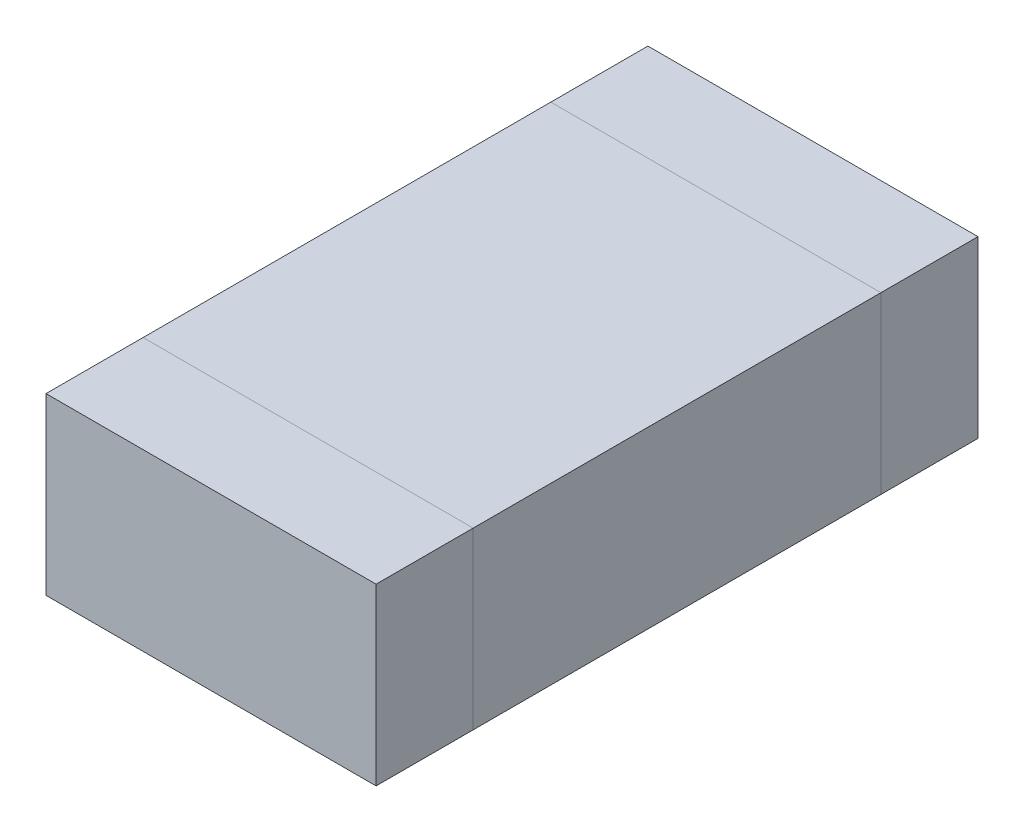
ISO-10303-21;
HEADER;
FILE_DESCRIPTION(('STEP AP214'),'2;1');
FILE_NAME('part.step','',(''),(''),'','','');
FILE_SCHEMA(('AUTOMOTIVE_DESIGN { 1 0 10303 214 1 1 1 1 }'));
ENDSEC;
DATA;
#1=APPLICATION_CONTEXT('core data for automotive mechanical design processes');
#2=APPLICATION_PROTOCOL_DEFINITION('international standard','automotive_design',2000,#1);
#3=PRODUCT_CONTEXT('',#1,'mechanical');
#4=PRODUCT('Part','Part','',(#3));
#5=PRODUCT_RELATED_PRODUCT_CATEGORY('part','',(#4));
#6=PRODUCT_DEFINITION_FORMATION('','',#4);
#7=PRODUCT_DEFINITION_CONTEXT('part definition',#1,'design');
#8=PRODUCT_DEFINITION('design','',#6,#7);
#9=PRODUCT_DEFINITION_SHAPE('','',#8);
#10=(LENGTH_UNIT() NAMED_UNIT(*) SI_UNIT(.MILLI.,.METRE.));
#11=(NAMED_UNIT(*) PLANE_ANGLE_UNIT() SI_UNIT($,.RADIAN.));
#12=(NAMED_UNIT(*) SI_UNIT($,.STERADIAN.) SOLID_ANGLE_UNIT());
#13=UNCERTAINTY_MEASURE_WITH_UNIT(LENGTH_MEASURE(1.E-05),#10,'distance_accuracy_value','');
#14=(GEOMETRIC_REPRESENTATION_CONTEXT(3) GLOBAL_UNCERTAINTY_ASSIGNED_CONTEXT((#13)) GLOBAL_UNIT_ASSIGNED_CONTEXT((#10,
#11,#12)) REPRESENTATION_CONTEXT('',''));
#15=CARTESIAN_POINT('',(0.,0.,0.));
#16=DIRECTION('',(0.,0.,1.));
#17=DIRECTION('',(1.,0.,0.));
#18=AXIS2_PLACEMENT_3D('',#15,#16,#17);
#19=CARTESIAN_POINT('',(0.,0.45,0.));
#20=DIRECTION('',(0.,1.,0.));
#21=DIRECTION('',(0.,0.,1.));
#22=AXIS2_PLACEMENT_3D('',#19,#20,#21);
#23=PLANE('',#22);
#24=DIRECTION('',(0.,0.,-1.));
#25=VECTOR('',#24,1.);
#26=CARTESIAN_POINT('',(-0.425,0.45,-0.525));
#27=LINE('',#26,#25);
#28=CARTESIAN_POINT('',(-0.425,0.45,-0.525));
#29=VERTEX_POINT('',#28);
#30=CARTESIAN_POINT('',(-0.425,0.45,-0.775));
#31=VERTEX_POINT('',#30);
#32=EDGE_CURVE('E51',#29,#31,#27,.T.);
#33=ORIENTED_EDGE('',*,*,#32,.F.);
#34=DIRECTION('',(-1.,0.,0.));
#35=VECTOR('',#34,1.);
#36=CARTESIAN_POINT('',(-0.425,0.45,-0.525));
#37=LINE('',#36,#35);
#38=CARTESIAN_POINT('',(0.425,0.45,-0.525));
#39=VERTEX_POINT('',#38);
#40=EDGE_CURVE('E74',#39,#29,#37,.T.);
#41=ORIENTED_EDGE('',*,*,#40,.F.);
#42=DIRECTION('',(0.,0.,1.));
#43=VECTOR('',#42,1.);
#44=CARTESIAN_POINT('',(0.425,0.45,-0.525));
#45=LINE('',#44,#43);
#46=CARTESIAN_POINT('',(0.425,0.45,-0.775));
#47=VERTEX_POINT('',#46);
#48=EDGE_CURVE('E79',#47,#39,#45,.T.);
#49=ORIENTED_EDGE('',*,*,#48,.F.);
#50=DIRECTION('',(1.,0.,0.));
#51=VECTOR('',#50,1.);
#52=CARTESIAN_POINT('',(-0.425,0.45,-0.775));
#53=LINE('',#52,#51);
#54=EDGE_CURVE('E94',#31,#47,#53,.T.);
#55=ORIENTED_EDGE('',*,*,#54,.F.);
#56=EDGE_LOOP('',(#33,#41,#49,#55));
#57=FACE_BOUND('',#56,.T.);
#58=ADVANCED_FACE('F43',(#57),#23,.T.);
#59=CARTESIAN_POINT('',(0.,0.,0.));
#60=DIRECTION('',(0.,-1.,0.));
#61=DIRECTION('',(0.,0.,-1.));
#62=AXIS2_PLACEMENT_3D('',#59,#60,#61);
#63=PLANE('',#62);
#64=DIRECTION('',(0.,0.,-1.));
#65=VECTOR('',#64,1.);
#66=CARTESIAN_POINT('',(-0.425,0.,-0.525));
#67=LINE('',#66,#65);
#68=CARTESIAN_POINT('',(-0.425,0.,-0.525));
#69=VERTEX_POINT('',#68);
#70=CARTESIAN_POINT('',(-0.425,0.,-0.775));
#71=VERTEX_POINT('',#70);
#72=EDGE_CURVE('E103',#69,#71,#67,.T.);
#73=ORIENTED_EDGE('',*,*,#72,.T.);
#74=DIRECTION('',(1.,0.,0.));
#75=VECTOR('',#74,1.);
#76=CARTESIAN_POINT('',(-0.425,0.,-0.775));
#77=LINE('',#76,#75);
#78=CARTESIAN_POINT('',(0.425,0.,-0.775));
#79=VERTEX_POINT('',#78);
#80=EDGE_CURVE('E92',#71,#79,#77,.T.);
#81=ORIENTED_EDGE('',*,*,#80,.T.);
#82=DIRECTION('',(0.,0.,1.));
#83=VECTOR('',#82,1.);
#84=CARTESIAN_POINT('',(0.425,0.,-0.525));
#85=LINE('',#84,#83);
#86=CARTESIAN_POINT('',(0.425,0.,-0.525));
#87=VERTEX_POINT('',#86);
#88=EDGE_CURVE('E95',#79,#87,#85,.T.);
#89=ORIENTED_EDGE('',*,*,#88,.T.);
#90=DIRECTION('',(-1.,0.,0.));
#91=VECTOR('',#90,1.);
#92=CARTESIAN_POINT('',(-0.425,0.,-0.525));
#93=LINE('',#92,#91);
#94=EDGE_CURVE('E100',#87,#69,#93,.T.);
#95=ORIENTED_EDGE('',*,*,#94,.T.);
#96=EDGE_LOOP('',(#73,#81,#89,#95));
#97=FACE_BOUND('',#96,.T.);
#98=ADVANCED_FACE('F102',(#97),#63,.T.);
#99=CARTESIAN_POINT('',(-0.425,1.33600225733347,-0.775));
#100=DIRECTION('',(0.,0.,-1.));
#101=DIRECTION('',(-1.,0.,0.));
#102=AXIS2_PLACEMENT_3D('',#99,#100,#101);
#103=PLANE('',#102);
#104=DIRECTION('',(0.,-1.,0.));
#105=VECTOR('',#104,1.);
#106=CARTESIAN_POINT('',(-0.425,1.33600225733347,-0.775));
#107=LINE('',#106,#105);
#108=EDGE_CURVE('E12',#31,#71,#107,.T.);
#109=ORIENTED_EDGE('',*,*,#108,.F.);
#110=ORIENTED_EDGE('',*,*,#54,.T.);
#111=DIRECTION('',(0.,-1.,0.));
#112=VECTOR('',#111,1.);
#113=CARTESIAN_POINT('',(0.425,1.33600225733347,-0.775));
#114=LINE('',#113,#112);
#115=EDGE_CURVE('E89',#47,#79,#114,.T.);
#116=ORIENTED_EDGE('',*,*,#115,.T.);
#117=ORIENTED_EDGE('',*,*,#80,.F.);
#118=EDGE_LOOP('',(#109,#110,#116,#117));
#119=FACE_BOUND('',#118,.T.);
#120=ADVANCED_FACE('F90',(#119),#103,.T.);
#121=CARTESIAN_POINT('',(0.425,1.33600225733347,-0.525));
#122=DIRECTION('',(1.,0.,0.));
#123=DIRECTION('',(0.,0.,-1.));
#124=AXIS2_PLACEMENT_3D('',#121,#122,#123);
#125=PLANE('',#124);
#126=ORIENTED_EDGE('',*,*,#115,.F.);
#127=ORIENTED_EDGE('',*,*,#48,.T.);
#128=DIRECTION('',(0.,-1.,0.));
#129=VECTOR('',#128,1.);
#130=CARTESIAN_POINT('',(0.425,1.33600225733347,-0.525));
#131=LINE('',#130,#129);
#132=EDGE_CURVE('E84',#39,#87,#131,.T.);
#133=ORIENTED_EDGE('',*,*,#132,.T.);
#134=ORIENTED_EDGE('',*,*,#88,.F.);
#135=EDGE_LOOP('',(#126,#127,#133,#134));
#136=FACE_BOUND('',#135,.T.);
#137=ADVANCED_FACE('F96',(#136),#125,.T.);
#138=CARTESIAN_POINT('',(-0.425,1.33600225733347,-0.525));
#139=DIRECTION('',(0.,0.,1.));
#140=DIRECTION('',(1.,0.,0.));
#141=AXIS2_PLACEMENT_3D('',#138,#139,#140);
#142=PLANE('',#141);
#143=ORIENTED_EDGE('',*,*,#132,.F.);
#144=ORIENTED_EDGE('',*,*,#40,.T.);
#145=DIRECTION('',(0.,-1.,0.));
#146=VECTOR('',#145,1.);
#147=CARTESIAN_POINT('',(-0.425,1.33600225733347,-0.525));
#148=LINE('',#147,#146);
#149=EDGE_CURVE('E110',#29,#69,#148,.T.);
#150=ORIENTED_EDGE('',*,*,#149,.T.);
#151=ORIENTED_EDGE('',*,*,#94,.F.);
#152=EDGE_LOOP('',(#143,#144,#150,#151));
#153=FACE_BOUND('',#152,.T.);
#154=ADVANCED_FACE('F116',(#153),#142,.T.);
#155=CARTESIAN_POINT('',(-0.425,1.33600225733347,-0.525));
#156=DIRECTION('',(-1.,0.,0.));
#157=DIRECTION('',(0.,0.,1.));
#158=AXIS2_PLACEMENT_3D('',#155,#156,#157);
#159=PLANE('',#158);
#160=ORIENTED_EDGE('',*,*,#149,.F.);
#161=ORIENTED_EDGE('',*,*,#32,.T.);
#162=ORIENTED_EDGE('',*,*,#108,.T.);
#163=ORIENTED_EDGE('',*,*,#72,.F.);
#164=EDGE_LOOP('',(#160,#161,#162,#163));
#165=FACE_BOUND('',#164,.T.);
#166=ADVANCED_FACE('F117',(#165),#159,.T.);
#167=CLOSED_SHELL('',(#58,#98,#120,#137,#154,#166));
#168=MANIFOLD_SOLID_BREP('B2',#167);
#169=CARTESIAN_POINT('',(0.,0.45,0.));
#170=DIRECTION('',(0.,1.,0.));
#171=DIRECTION('',(0.,0.,1.));
#172=AXIS2_PLACEMENT_3D('',#169,#170,#171);
#173=PLANE('',#172);
#174=DIRECTION('',(0.,0.,-1.));
#175=VECTOR('',#174,1.);
#176=CARTESIAN_POINT('',(-0.425,0.45,0.525));
#177=LINE('',#176,#175);
#178=CARTESIAN_POINT('',(-0.425,0.45,0.775));
#179=VERTEX_POINT('',#178);
#180=CARTESIAN_POINT('',(-0.425,0.45,0.525));
#181=VERTEX_POINT('',#180);
#182=EDGE_CURVE('E183',#179,#181,#177,.T.);
#183=ORIENTED_EDGE('',*,*,#182,.F.);
#184=DIRECTION('',(-1.,0.,0.));
#185=VECTOR('',#184,1.);
#186=CARTESIAN_POINT('',(-0.425,0.45,0.775));
#187=LINE('',#186,#185);
#188=CARTESIAN_POINT('',(0.425,0.45,0.775));
#189=VERTEX_POINT('',#188);
#190=EDGE_CURVE('E206',#189,#179,#187,.T.);
#191=ORIENTED_EDGE('',*,*,#190,.F.);
#192=DIRECTION('',(0.,0.,1.));
#193=VECTOR('',#192,1.);
#194=CARTESIAN_POINT('',(0.425,0.45,0.525));
#195=LINE('',#194,#193);
#196=CARTESIAN_POINT('',(0.425,0.45,0.525));
#197=VERTEX_POINT('',#196);
#198=EDGE_CURVE('E211',#197,#189,#195,.T.);
#199=ORIENTED_EDGE('',*,*,#198,.F.);
#200=DIRECTION('',(1.,0.,0.));
#201=VECTOR('',#200,1.);
#202=CARTESIAN_POINT('',(-0.425,0.45,0.525));
#203=LINE('',#202,#201);
#204=EDGE_CURVE('E226',#181,#197,#203,.T.);
#205=ORIENTED_EDGE('',*,*,#204,.F.);
#206=EDGE_LOOP('',(#183,#191,#199,#205));
#207=FACE_BOUND('',#206,.T.);
#208=ADVANCED_FACE('F175',(#207),#173,.T.);
#209=CARTESIAN_POINT('',(0.,0.,0.));
#210=DIRECTION('',(0.,1.,0.));
#211=DIRECTION('',(0.,0.,1.));
#212=AXIS2_PLACEMENT_3D('',#209,#210,#211);
#213=PLANE('',#212);
#214=DIRECTION('',(0.,0.,-1.));
#215=VECTOR('',#214,1.);
#216=CARTESIAN_POINT('',(-0.425,0.,0.525));
#217=LINE('',#216,#215);
#218=CARTESIAN_POINT('',(-0.425,0.,0.775));
#219=VERTEX_POINT('',#218);
#220=CARTESIAN_POINT('',(-0.425,0.,0.525));
#221=VERTEX_POINT('',#220);
#222=EDGE_CURVE('E235',#219,#221,#217,.T.);
#223=ORIENTED_EDGE('',*,*,#222,.T.);
#224=DIRECTION('',(1.,0.,0.));
#225=VECTOR('',#224,1.);
#226=CARTESIAN_POINT('',(-0.425,0.,0.525));
#227=LINE('',#226,#225);
#228=CARTESIAN_POINT('',(0.425,0.,0.525));
#229=VERTEX_POINT('',#228);
#230=EDGE_CURVE('E224',#221,#229,#227,.T.);
#231=ORIENTED_EDGE('',*,*,#230,.T.);
#232=DIRECTION('',(0.,0.,1.));
#233=VECTOR('',#232,1.);
#234=CARTESIAN_POINT('',(0.425,0.,0.525));
#235=LINE('',#234,#233);
#236=CARTESIAN_POINT('',(0.425,0.,0.775));
#237=VERTEX_POINT('',#236);
#238=EDGE_CURVE('E227',#229,#237,#235,.T.);
#239=ORIENTED_EDGE('',*,*,#238,.T.);
#240=DIRECTION('',(-1.,0.,0.));
#241=VECTOR('',#240,1.);
#242=CARTESIAN_POINT('',(-0.425,0.,0.775));
#243=LINE('',#242,#241);
#244=EDGE_CURVE('E232',#237,#219,#243,.T.);
#245=ORIENTED_EDGE('',*,*,#244,.T.);
#246=EDGE_LOOP('',(#223,#231,#239,#245));
#247=FACE_BOUND('',#246,.T.);
#248=ADVANCED_FACE('F234',(#247),#213,.F.);
#249=CARTESIAN_POINT('',(-0.425,1.33600225733347,0.525));
#250=DIRECTION('',(0.,0.,-1.));
#251=DIRECTION('',(-1.,0.,0.));
#252=AXIS2_PLACEMENT_3D('',#249,#250,#251);
#253=PLANE('',#252);
#254=DIRECTION('',(0.,-1.,0.));
#255=VECTOR('',#254,1.);
#256=CARTESIAN_POINT('',(-0.425,1.33600225733347,0.525));
#257=LINE('',#256,#255);
#258=EDGE_CURVE('E41',#181,#221,#257,.T.);
#259=ORIENTED_EDGE('',*,*,#258,.F.);
#260=ORIENTED_EDGE('',*,*,#204,.T.);
#261=DIRECTION('',(0.,-1.,0.));
#262=VECTOR('',#261,1.);
#263=CARTESIAN_POINT('',(0.425,1.33600225733347,0.525));
#264=LINE('',#263,#262);
#265=EDGE_CURVE('E221',#197,#229,#264,.T.);
#266=ORIENTED_EDGE('',*,*,#265,.T.);
#267=ORIENTED_EDGE('',*,*,#230,.F.);
#268=EDGE_LOOP('',(#259,#260,#266,#267));
#269=FACE_BOUND('',#268,.T.);
#270=ADVANCED_FACE('F222',(#269),#253,.T.);
#271=CARTESIAN_POINT('',(0.425,1.33600225733347,0.525));
#272=DIRECTION('',(1.,0.,0.));
#273=DIRECTION('',(0.,0.,-1.));
#274=AXIS2_PLACEMENT_3D('',#271,#272,#273);
#275=PLANE('',#274);
#276=ORIENTED_EDGE('',*,*,#265,.F.);
#277=ORIENTED_EDGE('',*,*,#198,.T.);
#278=DIRECTION('',(0.,-1.,0.));
#279=VECTOR('',#278,1.);
#280=CARTESIAN_POINT('',(0.425,1.33600225733347,0.775));
#281=LINE('',#280,#279);
#282=EDGE_CURVE('E216',#189,#237,#281,.T.);
#283=ORIENTED_EDGE('',*,*,#282,.T.);
#284=ORIENTED_EDGE('',*,*,#238,.F.);
#285=EDGE_LOOP('',(#276,#277,#283,#284));
#286=FACE_BOUND('',#285,.T.);
#287=ADVANCED_FACE('F228',(#286),#275,.T.);
#288=CARTESIAN_POINT('',(-0.425,1.33600225733347,0.775));
#289=DIRECTION('',(0.,0.,1.));
#290=DIRECTION('',(1.,0.,0.));
#291=AXIS2_PLACEMENT_3D('',#288,#289,#290);
#292=PLANE('',#291);
#293=ORIENTED_EDGE('',*,*,#282,.F.);
#294=ORIENTED_EDGE('',*,*,#190,.T.);
#295=DIRECTION('',(0.,-1.,0.));
#296=VECTOR('',#295,1.);
#297=CARTESIAN_POINT('',(-0.425,1.33600225733347,0.775));
#298=LINE('',#297,#296);
#299=EDGE_CURVE('E242',#179,#219,#298,.T.);
#300=ORIENTED_EDGE('',*,*,#299,.T.);
#301=ORIENTED_EDGE('',*,*,#244,.F.);
#302=EDGE_LOOP('',(#293,#294,#300,#301));
#303=FACE_BOUND('',#302,.T.);
#304=ADVANCED_FACE('F248',(#303),#292,.T.);
#305=CARTESIAN_POINT('',(-0.425,1.33600225733347,0.525));
#306=DIRECTION('',(-1.,0.,0.));
#307=DIRECTION('',(0.,0.,1.));
#308=AXIS2_PLACEMENT_3D('',#305,#306,#307);
#309=PLANE('',#308);
#310=ORIENTED_EDGE('',*,*,#299,.F.);
#311=ORIENTED_EDGE('',*,*,#182,.T.);
#312=ORIENTED_EDGE('',*,*,#258,.T.);
#313=ORIENTED_EDGE('',*,*,#222,.F.);
#314=EDGE_LOOP('',(#310,#311,#312,#313));
#315=FACE_BOUND('',#314,.T.);
#316=ADVANCED_FACE('F249',(#315),#309,.T.);
#317=CLOSED_SHELL('',(#208,#248,#270,#287,#304,#316));
#318=MANIFOLD_SOLID_BREP('B6',#317);
#319=CARTESIAN_POINT('',(0.425,0.45,-0.525));
#320=DIRECTION('',(-1.,0.,0.));
#321=DIRECTION('',(0.,0.,1.));
#322=AXIS2_PLACEMENT_3D('',#319,#320,#321);
#323=PLANE('',#322);
#324=DIRECTION('',(0.,0.,-1.));
#325=VECTOR('',#324,1.);
#326=CARTESIAN_POINT('',(0.425,0.,-0.525));
#327=LINE('',#326,#325);
#328=CARTESIAN_POINT('',(0.425,0.,0.525));
#329=VERTEX_POINT('',#328);
#330=CARTESIAN_POINT('',(0.425,0.,-0.525));
#331=VERTEX_POINT('',#330);
#332=EDGE_CURVE('E361',#329,#331,#327,.T.);
#333=ORIENTED_EDGE('',*,*,#332,.T.);
#334=DIRECTION('',(0.,-1.,0.));
#335=VECTOR('',#334,1.);
#336=CARTESIAN_POINT('',(0.425,0.45,-0.525));
#337=LINE('',#336,#335);
#338=CARTESIAN_POINT('',(0.425,0.45,-0.525));
#339=VERTEX_POINT('',#338);
#340=EDGE_CURVE('E173',#339,#331,#337,.T.);
#341=ORIENTED_EDGE('',*,*,#340,.F.);
#342=DIRECTION('',(0.,0.,-1.));
#343=VECTOR('',#342,1.);
#344=CARTESIAN_POINT('',(0.425,0.45,-0.525));
#345=LINE('',#344,#343);
#346=CARTESIAN_POINT('',(0.425,0.45,0.525));
#347=VERTEX_POINT('',#346);
#348=EDGE_CURVE('E349',#347,#339,#345,.T.);
#349=ORIENTED_EDGE('',*,*,#348,.F.);
#350=DIRECTION('',(0.,-1.,0.));
#351=VECTOR('',#350,1.);
#352=CARTESIAN_POINT('',(0.425,0.45,0.525));
#353=LINE('',#352,#351);
#354=EDGE_CURVE('E357',#347,#329,#353,.T.);
#355=ORIENTED_EDGE('',*,*,#354,.T.);
#356=EDGE_LOOP('',(#333,#341,#349,#355));
#357=FACE_BOUND('',#356,.T.);
#358=ADVANCED_FACE('F298',(#357),#323,.F.);
#359=CARTESIAN_POINT('',(-0.425,0.45,-0.525));
#360=DIRECTION('',(0.,0.,1.));
#361=DIRECTION('',(1.,0.,0.));
#362=AXIS2_PLACEMENT_3D('',#359,#360,#361);
#363=PLANE('',#362);
#364=DIRECTION('',(-1.,0.,0.));
#365=VECTOR('',#364,1.);
#366=CARTESIAN_POINT('',(-0.425,0.,-0.525));
#367=LINE('',#366,#365);
#368=CARTESIAN_POINT('',(-0.425,0.,-0.525));
#369=VERTEX_POINT('',#368);
#370=EDGE_CURVE('E353',#331,#369,#367,.T.);
#371=ORIENTED_EDGE('',*,*,#370,.T.);
#372=DIRECTION('',(0.,-1.,0.));
#373=VECTOR('',#372,1.);
#374=CARTESIAN_POINT('',(-0.425,0.45,-0.525));
#375=LINE('',#374,#373);
#376=CARTESIAN_POINT('',(-0.425,0.45,-0.525));
#377=VERTEX_POINT('',#376);
#378=EDGE_CURVE('E306',#377,#369,#375,.T.);
#379=ORIENTED_EDGE('',*,*,#378,.F.);
#380=DIRECTION('',(-1.,0.,0.));
#381=VECTOR('',#380,1.);
#382=CARTESIAN_POINT('',(-0.425,0.45,-0.525));
#383=LINE('',#382,#381);
#384=EDGE_CURVE('E344',#339,#377,#383,.T.);
#385=ORIENTED_EDGE('',*,*,#384,.F.);
#386=ORIENTED_EDGE('',*,*,#340,.T.);
#387=EDGE_LOOP('',(#371,#379,#385,#386));
#388=FACE_BOUND('',#387,.T.);
#389=ADVANCED_FACE('F352',(#388),#363,.F.);
#390=CARTESIAN_POINT('',(-0.425,0.45,-0.525));
#391=DIRECTION('',(1.,0.,0.));
#392=DIRECTION('',(0.,0.,-1.));
#393=AXIS2_PLACEMENT_3D('',#390,#391,#392);
#394=PLANE('',#393);
#395=DIRECTION('',(0.,0.,1.));
#396=VECTOR('',#395,1.);
#397=CARTESIAN_POINT('',(-0.425,0.,-0.525));
#398=LINE('',#397,#396);
#399=CARTESIAN_POINT('',(-0.425,0.,0.525));
#400=VERTEX_POINT('',#399);
#401=EDGE_CURVE('E331',#369,#400,#398,.T.);
#402=ORIENTED_EDGE('',*,*,#401,.T.);
#403=DIRECTION('',(0.,-1.,0.));
#404=VECTOR('',#403,1.);
#405=CARTESIAN_POINT('',(-0.425,0.45,0.525));
#406=LINE('',#405,#404);
#407=CARTESIAN_POINT('',(-0.425,0.45,0.525));
#408=VERTEX_POINT('',#407);
#409=EDGE_CURVE('E354',#408,#400,#406,.T.);
#410=ORIENTED_EDGE('',*,*,#409,.F.);
#411=DIRECTION('',(0.,0.,1.));
#412=VECTOR('',#411,1.);
#413=CARTESIAN_POINT('',(-0.425,0.45,-0.525));
#414=LINE('',#413,#412);
#415=EDGE_CURVE('E347',#377,#408,#414,.T.);
#416=ORIENTED_EDGE('',*,*,#415,.F.);
#417=ORIENTED_EDGE('',*,*,#378,.T.);
#418=EDGE_LOOP('',(#402,#410,#416,#417));
#419=FACE_BOUND('',#418,.T.);
#420=ADVANCED_FACE('F355',(#419),#394,.F.);
#421=CARTESIAN_POINT('',(-0.425,0.45,0.525));
#422=DIRECTION('',(0.,0.,-1.));
#423=DIRECTION('',(-1.,0.,0.));
#424=AXIS2_PLACEMENT_3D('',#421,#422,#423);
#425=PLANE('',#424);
#426=DIRECTION('',(1.,0.,0.));
#427=VECTOR('',#426,1.);
#428=CARTESIAN_POINT('',(-0.425,0.,0.525));
#429=LINE('',#428,#427);
#430=EDGE_CURVE('E337',#400,#329,#429,.T.);
#431=ORIENTED_EDGE('',*,*,#430,.T.);
#432=ORIENTED_EDGE('',*,*,#354,.F.);
#433=DIRECTION('',(1.,0.,0.));
#434=VECTOR('',#433,1.);
#435=CARTESIAN_POINT('',(-0.425,0.45,0.525));
#436=LINE('',#435,#434);
#437=EDGE_CURVE('E314',#408,#347,#436,.T.);
#438=ORIENTED_EDGE('',*,*,#437,.F.);
#439=ORIENTED_EDGE('',*,*,#409,.T.);
#440=EDGE_LOOP('',(#431,#432,#438,#439));
#441=FACE_BOUND('',#440,.T.);
#442=ADVANCED_FACE('F368',(#441),#425,.F.);
#443=CARTESIAN_POINT('',(0.,0.45,0.));
#444=DIRECTION('',(0.,1.,0.));
#445=DIRECTION('',(0.,0.,1.));
#446=AXIS2_PLACEMENT_3D('',#443,#444,#445);
#447=PLANE('',#446);
#448=ORIENTED_EDGE('',*,*,#348,.T.);
#449=ORIENTED_EDGE('',*,*,#384,.T.);
#450=ORIENTED_EDGE('',*,*,#415,.T.);
#451=ORIENTED_EDGE('',*,*,#437,.T.);
#452=EDGE_LOOP('',(#448,#449,#450,#451));
#453=FACE_BOUND('',#452,.T.);
#454=ADVANCED_FACE('F345',(#453),#447,.T.);
#455=CARTESIAN_POINT('',(0.,0.,0.));
#456=DIRECTION('',(0.,1.,0.));
#457=DIRECTION('',(0.,0.,1.));
#458=AXIS2_PLACEMENT_3D('',#455,#456,#457);
#459=PLANE('',#458);
#460=ORIENTED_EDGE('',*,*,#332,.F.);
#461=ORIENTED_EDGE('',*,*,#430,.F.);
#462=ORIENTED_EDGE('',*,*,#401,.F.);
#463=ORIENTED_EDGE('',*,*,#370,.F.);
#464=EDGE_LOOP('',(#460,#461,#462,#463));
#465=FACE_BOUND('',#464,.T.);
#466=ADVANCED_FACE('F371',(#465),#459,.F.);
#467=CLOSED_SHELL('',(#358,#389,#420,#442,#454,#466));
#468=MANIFOLD_SOLID_BREP('B35',#467);
#469=ADVANCED_BREP_SHAPE_REPRESENTATION('',(#18,#168,#318,#468),#14);
#470=SHAPE_DEFINITION_REPRESENTATION(#9,#469);
ENDSEC;
END-ISO-10303-21;
